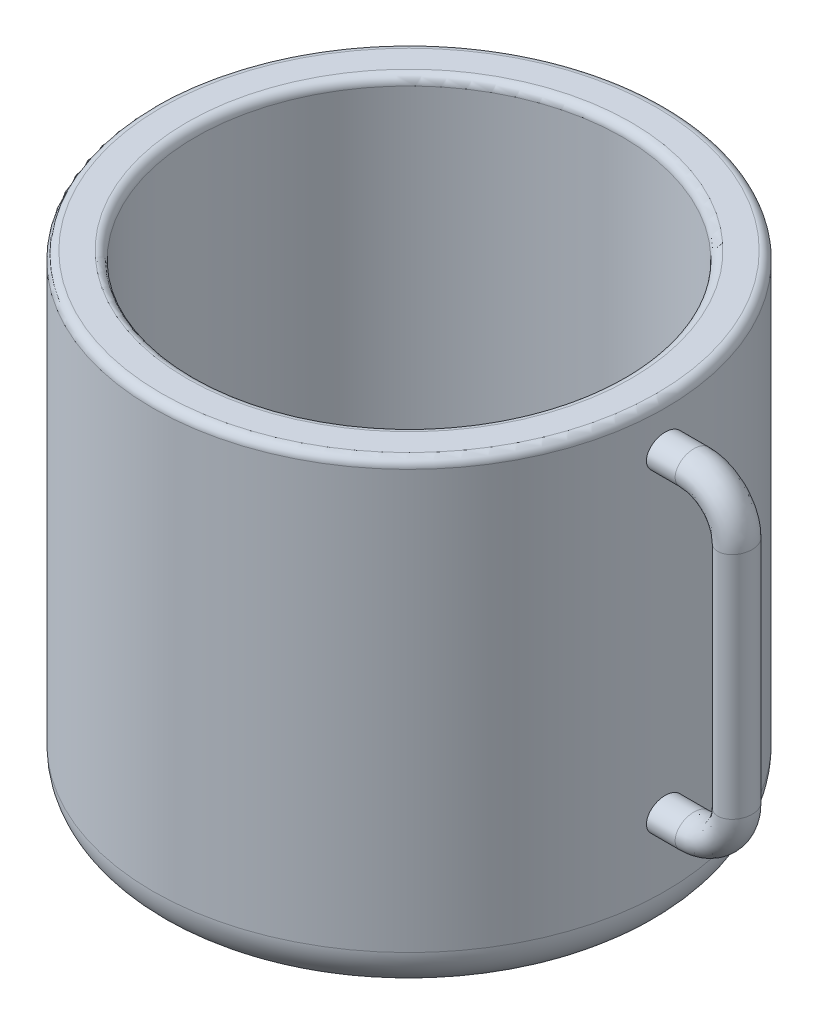
ISO-10303-21;
HEADER;
FILE_DESCRIPTION(('STEP AP214'),'2;1');
FILE_NAME('part.step','',(''),(''),'','','');
FILE_SCHEMA(('AUTOMOTIVE_DESIGN { 1 0 10303 214 1 1 1 1 }'));
ENDSEC;
DATA;
#1=APPLICATION_CONTEXT('core data for automotive mechanical design processes');
#2=APPLICATION_PROTOCOL_DEFINITION('international standard','automotive_design',2000,#1);
#3=PRODUCT_CONTEXT('',#1,'mechanical');
#4=PRODUCT('Part','Part','',(#3));
#5=PRODUCT_RELATED_PRODUCT_CATEGORY('part','',(#4));
#6=PRODUCT_DEFINITION_FORMATION('','',#4);
#7=PRODUCT_DEFINITION_CONTEXT('part definition',#1,'design');
#8=PRODUCT_DEFINITION('design','',#6,#7);
#9=PRODUCT_DEFINITION_SHAPE('','',#8);
#10=(LENGTH_UNIT() NAMED_UNIT(*) SI_UNIT(.MILLI.,.METRE.));
#11=(NAMED_UNIT(*) PLANE_ANGLE_UNIT() SI_UNIT($,.RADIAN.));
#12=(NAMED_UNIT(*) SI_UNIT($,.STERADIAN.) SOLID_ANGLE_UNIT());
#13=UNCERTAINTY_MEASURE_WITH_UNIT(LENGTH_MEASURE(1.E-05),#10,'distance_accuracy_value','');
#14=(GEOMETRIC_REPRESENTATION_CONTEXT(3) GLOBAL_UNCERTAINTY_ASSIGNED_CONTEXT((#13)) GLOBAL_UNIT_ASSIGNED_CONTEXT((#10,
#11,#12)) REPRESENTATION_CONTEXT('',''));
#15=CARTESIAN_POINT('',(0.,0.,0.));
#16=DIRECTION('',(0.,0.,1.));
#17=DIRECTION('',(1.,0.,0.));
#18=AXIS2_PLACEMENT_3D('',#15,#16,#17);
#19=CARTESIAN_POINT('',(0.,26.9469176367206,0.));
#20=DIRECTION('',(1.,0.,0.));
#21=DIRECTION('',(0.,0.,-1.));
#22=AXIS2_PLACEMENT_3D('',#19,#20,#21);
#23=PLANE('',#22);
#24=CARTESIAN_POINT('',(0.,26.9469176367206,0.));
#25=DIRECTION('',(1.,0.,0.));
#26=DIRECTION('',(0.,0.,-1.));
#27=AXIS2_PLACEMENT_3D('',#24,#25,#26);
#28=ELLIPSE('',#27,4.39736063591142,3.63919500903014);
#29=CARTESIAN_POINT('',(0.,26.9469176367206,-4.39736063591142));
#30=VERTEX_POINT('',#29);
#31=EDGE_CURVE('E72',#30,#30,#28,.T.);
#32=ORIENTED_EDGE('',*,*,#31,.F.);
#33=EDGE_LOOP('',(#32));
#34=FACE_BOUND('',#33,.T.);
#35=ADVANCED_FACE('F50',(#34),#23,.F.);
#36=CARTESIAN_POINT('',(0.,-46.7467812961402,0.));
#37=DIRECTION('',(-1.,0.,0.));
#38=DIRECTION('',(0.,0.,-1.));
#39=AXIS2_PLACEMENT_3D('',#36,#37,#38);
#40=PLANE('',#39);
#41=CARTESIAN_POINT('',(0.,-46.7467812961402,0.));
#42=DIRECTION('',(-1.,0.,0.));
#43=DIRECTION('',(0.,0.,-1.));
#44=AXIS2_PLACEMENT_3D('',#41,#42,#43);
#45=ELLIPSE('',#44,4.39736063591142,3.63919500903014);
#46=CARTESIAN_POINT('',(0.,-46.7467812961402,-4.39736063591142));
#47=VERTEX_POINT('',#46);
#48=EDGE_CURVE('E11',#47,#47,#45,.T.);
#49=ORIENTED_EDGE('',*,*,#48,.T.);
#50=EDGE_LOOP('',(#49));
#51=FACE_BOUND('',#50,.T.);
#52=ADVANCED_FACE('F79',(#51),#40,.T.);
#53=CARTESIAN_POINT('',(0.,26.9469176367206,-4.39736063591142));
#54=CARTESIAN_POINT('',(6.72636144038543,26.9469176367206,-4.39736063591142));
#55=CARTESIAN_POINT('',(0.,34.2253076547809,-4.39736063591142));
#56=CARTESIAN_POINT('',(6.72636144038543,34.2253076547809,-4.39736063591142));
#57=CARTESIAN_POINT('',(0.,34.2253076547809,4.39736063591142));
#58=CARTESIAN_POINT('',(6.72636144038543,34.2253076547809,4.39736063591142));
#59=CARTESIAN_POINT('',(0.,26.9469176367206,4.39736063591142));
#60=CARTESIAN_POINT('',(6.72636144038543,26.9469176367206,4.39736063591142));
#61=CARTESIAN_POINT('',(0.,19.6685276186603,4.39736063591142));
#62=CARTESIAN_POINT('',(6.72636144038543,19.6685276186603,4.39736063591142));
#63=CARTESIAN_POINT('',(0.,19.6685276186603,-4.39736063591142));
#64=CARTESIAN_POINT('',(6.72636144038543,19.6685276186603,-4.39736063591142));
#65=CARTESIAN_POINT('',(0.,26.9469176367206,-4.39736063591142));
#66=CARTESIAN_POINT('',(6.72636144038543,26.9469176367206,-4.39736063591142));
#67=(BOUNDED_SURFACE() B_SPLINE_SURFACE(3,1,((#53,#54),(#55,#56),(#57,#58),(#59,#60),(#61,#62),
(#63,#64),(#65,#66)),.UNSPECIFIED.,.T.,.F.,.F.) B_SPLINE_SURFACE_WITH_KNOTS((4,3,4),(2,2),(0.,
0.5,1.),(0.,1.),.UNSPECIFIED.) GEOMETRIC_REPRESENTATION_ITEM() RATIONAL_B_SPLINE_SURFACE(((1.,
1.),(0.333333333333333,0.333333333333333),(0.333333333333333,0.333333333333333),(1.,1.),
(0.333333333333333,0.333333333333333),(0.333333333333333,0.333333333333333),(1.,1.))) REPRESENTATION_ITEM('') SURFACE());
#68=CARTESIAN_POINT('',(6.72636144038543,26.9469176367206,0.));
#69=DIRECTION('',(1.,0.,0.));
#70=DIRECTION('',(0.,0.,-1.));
#71=AXIS2_PLACEMENT_3D('',#68,#69,#70);
#72=ELLIPSE('',#71,4.39736063591142,3.63919500903014);
#73=CARTESIAN_POINT('',(6.72636144038543,26.9469176367206,-4.39736063591142));
#74=VERTEX_POINT('',#73);
#75=EDGE_CURVE('E69',#74,#74,#72,.T.);
#76=ORIENTED_EDGE('',*,*,#75,.F.);
#77=EDGE_LOOP('',(#76));
#78=FACE_BOUND('',#77,.T.);
#79=ORIENTED_EDGE('',*,*,#31,.T.);
#80=EDGE_LOOP('',(#79));
#81=FACE_BOUND('',#80,.T.);
#82=ADVANCED_FACE('F76',(#78,#81),#67,.T.);
#83=CARTESIAN_POINT('',(6.72636144038563,26.9469176367206,-4.39736063591142));
#84=CARTESIAN_POINT('',(12.5842258166547,26.9469176367205,-4.39736063591142));
#85=CARTESIAN_POINT('',(16.7263614403857,22.8047820129895,-4.39736063591142));
#86=CARTESIAN_POINT('',(16.7263614403855,16.9469176367203,-4.39736063591142));
#87=CARTESIAN_POINT('',(6.72636144038563,34.2253076547809,-4.39736063591142));
#88=CARTESIAN_POINT('',(16.8478079769935,34.2253076547808,-4.39736063591142));
#89=CARTESIAN_POINT('',(24.004751458446,27.0683641733282,-4.39736063591142));
#90=CARTESIAN_POINT('',(24.0047514584458,16.9469176367202,-4.39736063591142));
#91=CARTESIAN_POINT('',(6.72636144038563,34.2253076547809,4.39736063591142));
#92=CARTESIAN_POINT('',(16.8478079769935,34.2253076547808,4.39736063591142));
#93=CARTESIAN_POINT('',(24.004751458446,27.0683641733282,4.39736063591142));
#94=CARTESIAN_POINT('',(24.0047514584458,16.9469176367202,4.39736063591142));
#95=CARTESIAN_POINT('',(6.72636144038563,26.9469176367206,4.39736063591142));
#96=CARTESIAN_POINT('',(12.5842258166547,26.9469176367205,4.39736063591142));
#97=CARTESIAN_POINT('',(16.7263614403857,22.8047820129895,4.39736063591142));
#98=CARTESIAN_POINT('',(16.7263614403855,16.9469176367203,4.39736063591142));
#99=CARTESIAN_POINT('',(6.72636144038563,19.6685276186603,4.39736063591142));
#100=CARTESIAN_POINT('',(8.32064365631594,19.6685276186603,4.39736063591142));
#101=CARTESIAN_POINT('',(9.44797142232531,18.5411998526508,4.39736063591142));
#102=CARTESIAN_POINT('',(9.44797142232521,16.9469176367204,4.39736063591142));
#103=CARTESIAN_POINT('',(6.72636144038563,19.6685276186603,-4.39736063591142));
#104=CARTESIAN_POINT('',(8.32064365631594,19.6685276186603,-4.39736063591142));
#105=CARTESIAN_POINT('',(9.44797142232531,18.5411998526508,-4.39736063591142));
#106=CARTESIAN_POINT('',(9.44797142232521,16.9469176367204,-4.39736063591142));
#107=CARTESIAN_POINT('',(6.72636144038563,26.9469176367206,-4.39736063591142));
#108=CARTESIAN_POINT('',(12.5842258166547,26.9469176367205,-4.39736063591142));
#109=CARTESIAN_POINT('',(16.7263614403857,22.8047820129895,-4.39736063591142));
#110=CARTESIAN_POINT('',(16.7263614403855,16.9469176367203,-4.39736063591142));
#111=(BOUNDED_SURFACE() B_SPLINE_SURFACE(3,3,((#83,#84,#85,#86),(#87,#88,#89,#90),(#91,#92,#93,
#94),(#95,#96,#97,#98),(#99,#100,#101,#102),(#103,#104,#105,#106),(#107,#108,#109,#110)),
.UNSPECIFIED.,.T.,.F.,.F.) B_SPLINE_SURFACE_WITH_KNOTS((4,3,4),(4,4),(0.,0.5,1.),(0.,1.),
.UNSPECIFIED.) GEOMETRIC_REPRESENTATION_ITEM() RATIONAL_B_SPLINE_SURFACE(((1.,0.804737854124362,
0.804737854124362,1.),(0.333333333333333,0.268245951374787,0.268245951374787,0.333333333333333),
(0.333333333333333,0.268245951374787,0.268245951374787,0.333333333333333),(1.,0.804737854124362,
0.804737854124362,1.),(0.333333333333333,0.268245951374787,0.268245951374787,0.333333333333333),
(0.333333333333333,0.268245951374787,0.268245951374787,0.333333333333333),(1.,0.804737854124362,
0.804737854124362,1.))) REPRESENTATION_ITEM('') SURFACE());
#112=CARTESIAN_POINT('',(16.7263614403855,16.9469176367205,0.));
#113=DIRECTION('',(0.,-1.,0.));
#114=DIRECTION('',(0.,0.,-1.));
#115=AXIS2_PLACEMENT_3D('',#112,#113,#114);
#116=ELLIPSE('',#115,4.39736063591142,3.63919500903014);
#117=CARTESIAN_POINT('',(16.7263614403855,16.9469176367205,-4.39736063591142));
#118=VERTEX_POINT('',#117);
#119=EDGE_CURVE('E64',#118,#118,#116,.T.);
#120=ORIENTED_EDGE('',*,*,#119,.F.);
#121=EDGE_LOOP('',(#120));
#122=FACE_BOUND('',#121,.T.);
#123=ORIENTED_EDGE('',*,*,#75,.T.);
#124=EDGE_LOOP('',(#123));
#125=FACE_BOUND('',#124,.T.);
#126=ADVANCED_FACE('F113',(#122,#125),#111,.T.);
#127=CARTESIAN_POINT('',(16.7263614403855,16.9469176367205,-4.39736063591142));
#128=CARTESIAN_POINT('',(16.7263614403855,-36.7467812961401,-4.39736063591142));
#129=CARTESIAN_POINT('',(24.0047514584458,16.9469176367205,-4.39736063591142));
#130=CARTESIAN_POINT('',(24.0047514584458,-36.7467812961401,-4.39736063591142));
#131=CARTESIAN_POINT('',(24.0047514584458,16.9469176367205,4.39736063591142));
#132=CARTESIAN_POINT('',(24.0047514584458,-36.7467812961401,4.39736063591142));
#133=CARTESIAN_POINT('',(16.7263614403855,16.9469176367205,4.39736063591142));
#134=CARTESIAN_POINT('',(16.7263614403855,-36.7467812961401,4.39736063591142));
#135=CARTESIAN_POINT('',(9.44797142232522,16.9469176367205,4.39736063591142));
#136=CARTESIAN_POINT('',(9.44797142232522,-36.7467812961401,4.39736063591142));
#137=CARTESIAN_POINT('',(9.44797142232522,16.9469176367205,-4.39736063591142));
#138=CARTESIAN_POINT('',(9.44797142232522,-36.7467812961401,-4.39736063591142));
#139=CARTESIAN_POINT('',(16.7263614403855,16.9469176367205,-4.39736063591142));
#140=CARTESIAN_POINT('',(16.7263614403855,-36.7467812961401,-4.39736063591142));
#141=(BOUNDED_SURFACE() B_SPLINE_SURFACE(3,1,((#127,#128),(#129,#130),(#131,#132),(#133,#134),
(#135,#136),(#137,#138),(#139,#140)),.UNSPECIFIED.,.T.,.F.,.F.) B_SPLINE_SURFACE_WITH_KNOTS((4,
3,4),(2,2),(0.,0.5,1.),(0.,1.),
.UNSPECIFIED.) GEOMETRIC_REPRESENTATION_ITEM() RATIONAL_B_SPLINE_SURFACE(((1.,1.),
(0.333333333333333,0.333333333333333),(0.333333333333333,0.333333333333333),(1.,1.),
(0.333333333333333,0.333333333333333),(0.333333333333333,0.333333333333333),(1.,1.))) REPRESENTATION_ITEM('') SURFACE());
#142=CARTESIAN_POINT('',(16.7263614403855,-36.7467812961401,0.));
#143=DIRECTION('',(0.,-1.,0.));
#144=DIRECTION('',(0.,0.,-1.));
#145=AXIS2_PLACEMENT_3D('',#142,#143,#144);
#146=ELLIPSE('',#145,4.39736063591142,3.63919500903014);
#147=CARTESIAN_POINT('',(16.7263614403855,-36.7467812961401,-4.39736063591142));
#148=VERTEX_POINT('',#147);
#149=EDGE_CURVE('E60',#148,#148,#146,.T.);
#150=ORIENTED_EDGE('',*,*,#149,.F.);
#151=EDGE_LOOP('',(#150));
#152=FACE_BOUND('',#151,.T.);
#153=ORIENTED_EDGE('',*,*,#119,.T.);
#154=EDGE_LOOP('',(#153));
#155=FACE_BOUND('',#154,.T.);
#156=ADVANCED_FACE('F91',(#152,#155),#141,.T.);
#157=CARTESIAN_POINT('',(16.7263614403855,-36.7467812961401,-4.39736063591142));
#158=CARTESIAN_POINT('',(16.7263614403855,-42.6046456724092,-4.39736063591142));
#159=CARTESIAN_POINT('',(12.5842258166545,-46.7467812961402,-4.39736063591142));
#160=CARTESIAN_POINT('',(6.72636144038544,-46.7467812961402,-4.39736063591142));
#161=CARTESIAN_POINT('',(24.0047514584458,-36.74678129614,-4.39736063591142));
#162=CARTESIAN_POINT('',(24.0047514584459,-46.868227832748,-4.39736063591142));
#163=CARTESIAN_POINT('',(16.8478079769933,-54.0251713142005,-4.39736063591142));
#164=CARTESIAN_POINT('',(6.72636144038538,-54.0251713142004,-4.39736063591142));
#165=CARTESIAN_POINT('',(24.0047514584458,-36.74678129614,4.39736063591142));
#166=CARTESIAN_POINT('',(24.0047514584459,-46.868227832748,4.39736063591142));
#167=CARTESIAN_POINT('',(16.8478079769933,-54.0251713142005,4.39736063591142));
#168=CARTESIAN_POINT('',(6.72636144038538,-54.0251713142004,4.39736063591142));
#169=CARTESIAN_POINT('',(16.7263614403855,-36.7467812961401,4.39736063591142));
#170=CARTESIAN_POINT('',(16.7263614403855,-42.6046456724092,4.39736063591142));
#171=CARTESIAN_POINT('',(12.5842258166545,-46.7467812961402,4.39736063591142));
#172=CARTESIAN_POINT('',(6.72636144038544,-46.7467812961402,4.39736063591142));
#173=CARTESIAN_POINT('',(9.44797142232522,-36.7467812961401,4.39736063591142));
#174=CARTESIAN_POINT('',(9.44797142232522,-38.3410635120704,4.39736063591142));
#175=CARTESIAN_POINT('',(8.32064365631578,-39.4683912780799,4.39736063591142));
#176=CARTESIAN_POINT('',(6.72636144038548,-39.4683912780799,4.39736063591142));
#177=CARTESIAN_POINT('',(9.44797142232522,-36.7467812961401,-4.39736063591142));
#178=CARTESIAN_POINT('',(9.44797142232522,-38.3410635120704,-4.39736063591142));
#179=CARTESIAN_POINT('',(8.32064365631578,-39.4683912780799,-4.39736063591142));
#180=CARTESIAN_POINT('',(6.72636144038548,-39.4683912780799,-4.39736063591142));
#181=CARTESIAN_POINT('',(16.7263614403855,-36.7467812961401,-4.39736063591142));
#182=CARTESIAN_POINT('',(16.7263614403855,-42.6046456724092,-4.39736063591142));
#183=CARTESIAN_POINT('',(12.5842258166545,-46.7467812961402,-4.39736063591142));
#184=CARTESIAN_POINT('',(6.72636144038544,-46.7467812961402,-4.39736063591142));
#185=(BOUNDED_SURFACE() B_SPLINE_SURFACE(3,3,((#157,#158,#159,#160),(#161,#162,#163,#164),(#165,
#166,#167,#168),(#169,#170,#171,#172),(#173,#174,#175,#176),(#177,#178,#179,#180),(#181,#182,
#183,#184)),.UNSPECIFIED.,.T.,.F.,.F.) B_SPLINE_SURFACE_WITH_KNOTS((4,3,4),(4,4),(0.,0.5,1.),
(0.,1.),.UNSPECIFIED.) GEOMETRIC_REPRESENTATION_ITEM() RATIONAL_B_SPLINE_SURFACE(((1.,
0.804737854124362,0.804737854124362,1.),(0.333333333333333,0.268245951374787,0.268245951374787,
0.333333333333333),(0.333333333333333,0.268245951374787,0.268245951374787,0.333333333333333),
(1.,0.804737854124362,0.804737854124362,1.),(0.333333333333333,0.268245951374787,
0.268245951374787,0.333333333333333),(0.333333333333333,0.268245951374787,0.268245951374787,
0.333333333333333),(1.,0.804737854124362,0.804737854124362,1.))) REPRESENTATION_ITEM('') SURFACE());
#186=CARTESIAN_POINT('',(6.72636144038543,-46.7467812961402,0.));
#187=DIRECTION('',(-1.,0.,0.));
#188=DIRECTION('',(0.,0.,-1.));
#189=AXIS2_PLACEMENT_3D('',#186,#187,#188);
#190=ELLIPSE('',#189,4.39736063591142,3.63919500903014);
#191=CARTESIAN_POINT('',(6.72636144038543,-46.7467812961402,-4.39736063591142));
#192=VERTEX_POINT('',#191);
#193=EDGE_CURVE('E56',#192,#192,#190,.T.);
#194=ORIENTED_EDGE('',*,*,#193,.F.);
#195=EDGE_LOOP('',(#194));
#196=FACE_BOUND('',#195,.T.);
#197=ORIENTED_EDGE('',*,*,#149,.T.);
#198=EDGE_LOOP('',(#197));
#199=FACE_BOUND('',#198,.T.);
#200=ADVANCED_FACE('F85',(#196,#199),#185,.T.);
#201=CARTESIAN_POINT('',(6.72636144038543,-46.7467812961402,-4.39736063591142));
#202=CARTESIAN_POINT('',(0.,-46.7467812961402,-4.39736063591142));
#203=CARTESIAN_POINT('',(6.72636144038543,-54.0251713142004,-4.39736063591142));
#204=CARTESIAN_POINT('',(0.,-54.0251713142004,-4.39736063591142));
#205=CARTESIAN_POINT('',(6.72636144038543,-54.0251713142004,4.39736063591142));
#206=CARTESIAN_POINT('',(0.,-54.0251713142004,4.39736063591142));
#207=CARTESIAN_POINT('',(6.72636144038543,-46.7467812961402,4.39736063591142));
#208=CARTESIAN_POINT('',(0.,-46.7467812961402,4.39736063591142));
#209=CARTESIAN_POINT('',(6.72636144038543,-39.4683912780799,4.39736063591142));
#210=CARTESIAN_POINT('',(0.,-39.4683912780799,4.39736063591142));
#211=CARTESIAN_POINT('',(6.72636144038543,-39.4683912780799,-4.39736063591142));
#212=CARTESIAN_POINT('',(0.,-39.4683912780799,-4.39736063591142));
#213=CARTESIAN_POINT('',(6.72636144038543,-46.7467812961402,-4.39736063591142));
#214=CARTESIAN_POINT('',(0.,-46.7467812961402,-4.39736063591142));
#215=(BOUNDED_SURFACE() B_SPLINE_SURFACE(3,1,((#201,#202),(#203,#204),(#205,#206),(#207,#208),
(#209,#210),(#211,#212),(#213,#214)),.UNSPECIFIED.,.T.,.F.,.F.) B_SPLINE_SURFACE_WITH_KNOTS((4,
3,4),(2,2),(0.,0.5,1.),(0.,1.),
.UNSPECIFIED.) GEOMETRIC_REPRESENTATION_ITEM() RATIONAL_B_SPLINE_SURFACE(((1.,1.),
(0.333333333333333,0.333333333333333),(0.333333333333333,0.333333333333333),(1.,1.),
(0.333333333333333,0.333333333333333),(0.333333333333333,0.333333333333333),(1.,1.))) REPRESENTATION_ITEM('') SURFACE());
#216=ORIENTED_EDGE('',*,*,#48,.F.);
#217=EDGE_LOOP('',(#216));
#218=FACE_BOUND('',#217,.T.);
#219=ORIENTED_EDGE('',*,*,#193,.T.);
#220=EDGE_LOOP('',(#219));
#221=FACE_BOUND('',#220,.T.);
#222=ADVANCED_FACE('F83',(#218,#221),#215,.T.);
#223=CLOSED_SHELL('',(#35,#52,#82,#126,#156,#200,#222));
#224=MANIFOLD_SOLID_BREP('B2',#223);
#225=CARTESIAN_POINT('',(-60.,37.4425953387891,0.));
#226=DIRECTION('',(0.,1.,0.));
#227=DIRECTION('',(0.,0.,1.));
#228=AXIS2_PLACEMENT_3D('',#225,#226,#227);
#229=CYLINDRICAL_SURFACE('',#228,60.);
#230=CARTESIAN_POINT('',(-60.,35.4425953387891,0.));
#231=DIRECTION('',(0.,1.,0.));
#232=DIRECTION('',(0.,0.,1.));
#233=AXIS2_PLACEMENT_3D('',#230,#231,#232);
#234=CIRCLE('',#233,60.);
#235=CARTESIAN_POINT('',(-60.,35.4425953387891,60.));
#236=VERTEX_POINT('',#235);
#237=EDGE_CURVE('E49',#236,#236,#234,.T.);
#238=ORIENTED_EDGE('',*,*,#237,.F.);
#239=EDGE_LOOP('',(#238));
#240=FACE_BOUND('',#239,.T.);
#241=CARTESIAN_POINT('',(-60.,-62.5574046612109,0.));
#242=DIRECTION('',(0.,1.,0.));
#243=DIRECTION('',(0.,0.,1.));
#244=AXIS2_PLACEMENT_3D('',#241,#242,#243);
#245=CIRCLE('',#244,60.);
#246=CARTESIAN_POINT('',(-60.,-62.5574046612109,60.));
#247=VERTEX_POINT('',#246);
#248=EDGE_CURVE('E230',#247,#247,#245,.T.);
#249=ORIENTED_EDGE('',*,*,#248,.T.);
#250=EDGE_LOOP('',(#249));
#251=FACE_BOUND('',#250,.T.);
#252=ADVANCED_FACE('F199',(#240,#251),#229,.T.);
#253=CARTESIAN_POINT('',(-60.,35.4425953387891,0.));
#254=DIRECTION('',(0.,1.,0.));
#255=DIRECTION('',(0.,0.,1.));
#256=AXIS2_PLACEMENT_3D('',#253,#254,#255);
#257=TOROIDAL_SURFACE('',#256,58.,2.);
#258=CARTESIAN_POINT('',(-60.,37.4425953387891,0.));
#259=DIRECTION('',(0.,1.,0.));
#260=DIRECTION('',(0.,0.,1.));
#261=AXIS2_PLACEMENT_3D('',#258,#259,#260);
#262=CIRCLE('',#261,58.);
#263=CARTESIAN_POINT('',(-60.,37.4425953387891,58.));
#264=VERTEX_POINT('',#263);
#265=EDGE_CURVE('E206',#264,#264,#262,.T.);
#266=ORIENTED_EDGE('',*,*,#265,.F.);
#267=EDGE_LOOP('',(#266));
#268=FACE_BOUND('',#267,.T.);
#269=ORIENTED_EDGE('',*,*,#237,.T.);
#270=EDGE_LOOP('',(#269));
#271=FACE_BOUND('',#270,.T.);
#272=ADVANCED_FACE('F253',(#268,#271),#257,.T.);
#273=CARTESIAN_POINT('',(-2.00000000000001,37.4425953387891,0.));
#274=DIRECTION('',(0.,-1.,0.));
#275=DIRECTION('',(0.,0.,-1.));
#276=AXIS2_PLACEMENT_3D('',#273,#274,#275);
#277=PLANE('',#276);
#278=CARTESIAN_POINT('',(-60.,37.4425953387891,0.));
#279=DIRECTION('',(0.,1.,0.));
#280=DIRECTION('',(0.,0.,1.));
#281=AXIS2_PLACEMENT_3D('',#278,#279,#280);
#282=CIRCLE('',#281,52.);
#283=CARTESIAN_POINT('',(-60.,37.4425953387891,52.));
#284=VERTEX_POINT('',#283);
#285=EDGE_CURVE('E211',#284,#284,#282,.T.);
#286=ORIENTED_EDGE('',*,*,#285,.F.);
#287=EDGE_LOOP('',(#286));
#288=FACE_BOUND('',#287,.T.);
#289=ORIENTED_EDGE('',*,*,#265,.T.);
#290=EDGE_LOOP('',(#289));
#291=FACE_BOUND('',#290,.T.);
#292=ADVANCED_FACE('F258',(#288,#291),#277,.F.);
#293=CARTESIAN_POINT('',(-60.,35.4425953387891,0.));
#294=DIRECTION('',(0.,1.,0.));
#295=DIRECTION('',(0.,0.,1.));
#296=AXIS2_PLACEMENT_3D('',#293,#294,#295);
#297=TOROIDAL_SURFACE('',#296,52.,2.);
#298=CARTESIAN_POINT('',(-60.,35.4425953387891,0.));
#299=DIRECTION('',(0.,1.,0.));
#300=DIRECTION('',(0.,0.,1.));
#301=AXIS2_PLACEMENT_3D('',#298,#299,#300);
#302=CIRCLE('',#301,50.);
#303=CARTESIAN_POINT('',(-60.,35.4425953387891,50.));
#304=VERTEX_POINT('',#303);
#305=EDGE_CURVE('E216',#304,#304,#302,.T.);
#306=ORIENTED_EDGE('',*,*,#305,.F.);
#307=EDGE_LOOP('',(#306));
#308=FACE_BOUND('',#307,.T.);
#309=ORIENTED_EDGE('',*,*,#285,.T.);
#310=EDGE_LOOP('',(#309));
#311=FACE_BOUND('',#310,.T.);
#312=ADVANCED_FACE('F263',(#308,#311),#297,.T.);
#313=CARTESIAN_POINT('',(-60.,37.4425953387891,0.));
#314=DIRECTION('',(0.,1.,0.));
#315=DIRECTION('',(0.,0.,1.));
#316=AXIS2_PLACEMENT_3D('',#313,#314,#315);
#317=CYLINDRICAL_SURFACE('',#316,50.);
#318=CARTESIAN_POINT('',(-60.,-62.5574046612109,0.));
#319=DIRECTION('',(0.,1.,0.));
#320=DIRECTION('',(0.,0.,1.));
#321=AXIS2_PLACEMENT_3D('',#318,#319,#320);
#322=CIRCLE('',#321,50.);
#323=CARTESIAN_POINT('',(-60.,-62.5574046612109,50.));
#324=VERTEX_POINT('',#323);
#325=EDGE_CURVE('E222',#324,#324,#322,.T.);
#326=ORIENTED_EDGE('',*,*,#325,.F.);
#327=EDGE_LOOP('',(#326));
#328=FACE_BOUND('',#327,.T.);
#329=ORIENTED_EDGE('',*,*,#305,.T.);
#330=EDGE_LOOP('',(#329));
#331=FACE_BOUND('',#330,.T.);
#332=ADVANCED_FACE('F249',(#328,#331),#317,.F.);
#333=CARTESIAN_POINT('',(-9.99999999999999,-62.5574046612109,0.));
#334=DIRECTION('',(0.,-1.,0.));
#335=DIRECTION('',(0.,0.,-1.));
#336=AXIS2_PLACEMENT_3D('',#333,#334,#335);
#337=PLANE('',#336);
#338=ORIENTED_EDGE('',*,*,#325,.T.);
#339=EDGE_LOOP('',(#338));
#340=FACE_BOUND('',#339,.T.);
#341=ADVANCED_FACE('F244',(#340),#337,.F.);
#342=CARTESIAN_POINT('',(-60.,-72.5574046612109,0.));
#343=DIRECTION('',(0.,1.,0.));
#344=DIRECTION('',(0.,0.,1.));
#345=AXIS2_PLACEMENT_3D('',#342,#343,#344);
#346=PLANE('',#345);
#347=CARTESIAN_POINT('',(-60.,-72.5574046612109,0.));
#348=DIRECTION('',(0.,1.,0.));
#349=DIRECTION('',(0.,0.,1.));
#350=AXIS2_PLACEMENT_3D('',#347,#348,#349);
#351=CIRCLE('',#350,49.9999999999999);
#352=CARTESIAN_POINT('',(-60.,-72.5574046612109,49.9999999999999));
#353=VERTEX_POINT('',#352);
#354=EDGE_CURVE('E226',#353,#353,#351,.T.);
#355=ORIENTED_EDGE('',*,*,#354,.F.);
#356=EDGE_LOOP('',(#355));
#357=FACE_BOUND('',#356,.T.);
#358=ADVANCED_FACE('F239',(#357),#346,.F.);
#359=CARTESIAN_POINT('',(-60.,-62.5574046612109,0.));
#360=DIRECTION('',(0.,1.,0.));
#361=DIRECTION('',(0.,0.,1.));
#362=AXIS2_PLACEMENT_3D('',#359,#360,#361);
#363=TOROIDAL_SURFACE('',#362,50.,10.);
#364=ORIENTED_EDGE('',*,*,#248,.F.);
#365=EDGE_LOOP('',(#364));
#366=FACE_BOUND('',#365,.T.);
#367=ORIENTED_EDGE('',*,*,#354,.T.);
#368=EDGE_LOOP('',(#367));
#369=FACE_BOUND('',#368,.T.);
#370=ADVANCED_FACE('F236',(#366,#369),#363,.T.);
#371=CLOSED_SHELL('',(#252,#272,#292,#312,#332,#341,#358,#370));
#372=MANIFOLD_SOLID_BREP('B6',#371);
#373=ADVANCED_BREP_SHAPE_REPRESENTATION('',(#18,#224,#372),#14);
#374=SHAPE_DEFINITION_REPRESENTATION(#9,#373);
ENDSEC;
END-ISO-10303-21;
